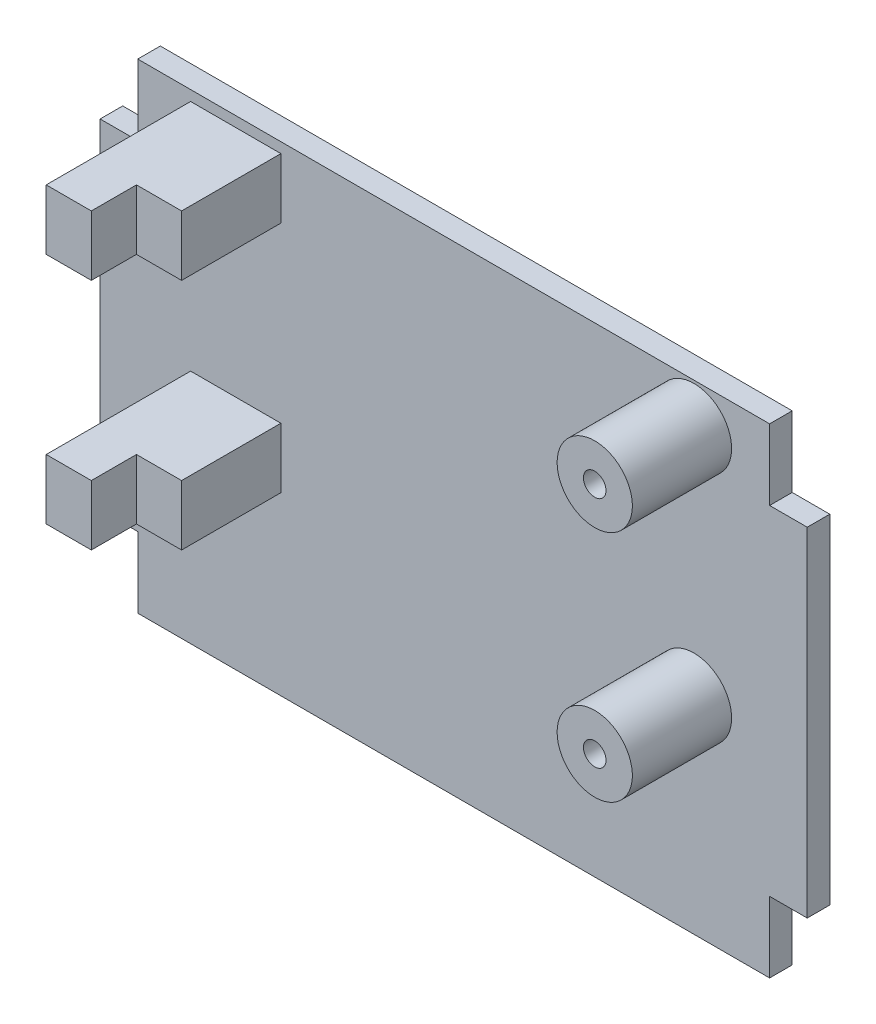
ISO-10303-21;
HEADER;
FILE_DESCRIPTION(('STEP AP214'),'2;1');
FILE_NAME('part.step','',(''),(''),'','','');
FILE_SCHEMA(('AUTOMOTIVE_DESIGN { 1 0 10303 214 1 1 1 1 }'));
ENDSEC;
DATA;
#1=APPLICATION_CONTEXT('core data for automotive mechanical design processes');
#2=APPLICATION_PROTOCOL_DEFINITION('international standard','automotive_design',2000,#1);
#3=PRODUCT_CONTEXT('',#1,'mechanical');
#4=PRODUCT('Part','Part','',(#3));
#5=PRODUCT_RELATED_PRODUCT_CATEGORY('part','',(#4));
#6=PRODUCT_DEFINITION_FORMATION('','',#4);
#7=PRODUCT_DEFINITION_CONTEXT('part definition',#1,'design');
#8=PRODUCT_DEFINITION('design','',#6,#7);
#9=PRODUCT_DEFINITION_SHAPE('','',#8);
#10=(LENGTH_UNIT() NAMED_UNIT(*) SI_UNIT(.MILLI.,.METRE.));
#11=(NAMED_UNIT(*) PLANE_ANGLE_UNIT() SI_UNIT($,.RADIAN.));
#12=(NAMED_UNIT(*) SI_UNIT($,.STERADIAN.) SOLID_ANGLE_UNIT());
#13=UNCERTAINTY_MEASURE_WITH_UNIT(LENGTH_MEASURE(1.E-05),#10,'distance_accuracy_value','');
#14=(GEOMETRIC_REPRESENTATION_CONTEXT(3) GLOBAL_UNCERTAINTY_ASSIGNED_CONTEXT((#13)) GLOBAL_UNIT_ASSIGNED_CONTEXT((#10,
#11,#12)) REPRESENTATION_CONTEXT('',''));
#15=CARTESIAN_POINT('',(0.,0.,0.));
#16=DIRECTION('',(0.,0.,1.));
#17=DIRECTION('',(1.,0.,0.));
#18=AXIS2_PLACEMENT_3D('',#15,#16,#17);
#19=CARTESIAN_POINT('',(11.5740112169334,16.372500000003,8.09906441460411));
#20=DIRECTION('',(0.,0.,-1.));
#21=DIRECTION('',(-1.,0.,0.));
#22=AXIS2_PLACEMENT_3D('',#19,#20,#21);
#23=PLANE('',#22);
#24=DIRECTION('',(0.,1.,0.));
#25=VECTOR('',#24,1.);
#26=CARTESIAN_POINT('',(9.01401121693351,0.,8.09906441460411));
#27=LINE('',#26,#25);
#28=CARTESIAN_POINT('',(9.01401121693351,11.6925000000033,8.09906441460411));
#29=VERTEX_POINT('',#28);
#30=CARTESIAN_POINT('',(9.01401121693351,15.6925000000032,8.09906441460411));
#31=VERTEX_POINT('',#30);
#32=EDGE_CURVE('E49',#29,#31,#27,.T.);
#33=ORIENTED_EDGE('',*,*,#32,.F.);
#34=DIRECTION('',(-1.,0.,0.));
#35=VECTOR('',#34,1.);
#36=CARTESIAN_POINT('',(6.01401121693351,11.6925000000033,8.09906441460411));
#37=LINE('',#36,#35);
#38=CARTESIAN_POINT('',(12.0140112169335,11.6925000000033,8.09906441460411));
#39=VERTEX_POINT('',#38);
#40=EDGE_CURVE('E255',#39,#29,#37,.T.);
#41=ORIENTED_EDGE('',*,*,#40,.F.);
#42=DIRECTION('',(0.,-1.,0.));
#43=VECTOR('',#42,1.);
#44=CARTESIAN_POINT('',(12.0140112169335,11.6925000000033,8.09906441460411));
#45=LINE('',#44,#43);
#46=CARTESIAN_POINT('',(12.0140112169335,15.6925000000033,8.09906441460411));
#47=VERTEX_POINT('',#46);
#48=EDGE_CURVE('E252',#47,#39,#45,.T.);
#49=ORIENTED_EDGE('',*,*,#48,.F.);
#50=DIRECTION('',(1.,0.,0.));
#51=VECTOR('',#50,1.);
#52=CARTESIAN_POINT('',(6.01401121693352,15.6925000000033,8.09906441460411));
#53=LINE('',#52,#51);
#54=EDGE_CURVE('E208',#31,#47,#53,.T.);
#55=ORIENTED_EDGE('',*,*,#54,.F.);
#56=EDGE_LOOP('',(#33,#41,#49,#55));
#57=FACE_BOUND('',#56,.T.);
#58=ADVANCED_FACE('F34',(#57),#23,.F.);
#59=CARTESIAN_POINT('',(0.,0.,1.5));
#60=DIRECTION('',(0.,0.,-1.));
#61=DIRECTION('',(-1.,0.,0.));
#62=AXIS2_PLACEMENT_3D('',#59,#60,#61);
#63=PLANE('',#62);
#64=DIRECTION('',(-1.,0.,0.));
#65=VECTOR('',#64,1.);
#66=CARTESIAN_POINT('',(6.01401121693352,31.2125000000011,1.5));
#67=LINE('',#66,#65);
#68=CARTESIAN_POINT('',(12.0140112169335,31.2125000000011,1.5));
#69=VERTEX_POINT('',#68);
#70=CARTESIAN_POINT('',(6.01401121693352,31.2125000000011,1.5));
#71=VERTEX_POINT('',#70);
#72=EDGE_CURVE('E294',#69,#71,#67,.T.);
#73=ORIENTED_EDGE('',*,*,#72,.F.);
#74=DIRECTION('',(0.,1.,0.));
#75=VECTOR('',#74,1.);
#76=CARTESIAN_POINT('',(12.0140112169335,31.2125000000011,1.5));
#77=LINE('',#76,#75);
#78=CARTESIAN_POINT('',(12.0140112169335,27.2125000000011,1.5));
#79=VERTEX_POINT('',#78);
#80=EDGE_CURVE('E291',#79,#69,#77,.T.);
#81=ORIENTED_EDGE('',*,*,#80,.F.);
#82=DIRECTION('',(1.,0.,0.));
#83=VECTOR('',#82,1.);
#84=CARTESIAN_POINT('',(6.01401121693352,27.2125000000011,1.5));
#85=LINE('',#84,#83);
#86=CARTESIAN_POINT('',(6.01401121693352,27.2125000000011,1.5));
#87=VERTEX_POINT('',#86);
#88=EDGE_CURVE('E288',#87,#79,#85,.T.);
#89=ORIENTED_EDGE('',*,*,#88,.F.);
#90=DIRECTION('',(0.,-1.,0.));
#91=VECTOR('',#90,1.);
#92=CARTESIAN_POINT('',(6.01401121693352,31.2125000000011,1.5));
#93=LINE('',#92,#91);
#94=EDGE_CURVE('E277',#71,#87,#93,.T.);
#95=ORIENTED_EDGE('',*,*,#94,.F.);
#96=EDGE_LOOP('',(#73,#81,#89,#95));
#97=FACE_BOUND('',#96,.T.);
#98=CARTESIAN_POINT('',(39.4740112169336,29.2125000000011,1.5));
#99=DIRECTION('',(0.,0.,-1.));
#100=DIRECTION('',(-1.,0.,0.));
#101=AXIS2_PLACEMENT_3D('',#98,#99,#100);
#102=CIRCLE('',#101,2.5);
#103=CARTESIAN_POINT('',(36.9740112169336,29.2125000000011,1.5));
#104=VERTEX_POINT('',#103);
#105=EDGE_CURVE('E42',#104,#104,#102,.F.);
#106=ORIENTED_EDGE('',*,*,#105,.F.);
#107=EDGE_LOOP('',(#106));
#108=FACE_BOUND('',#107,.T.);
#109=DIRECTION('',(-1.,0.,0.));
#110=VECTOR('',#109,1.);
#111=CARTESIAN_POINT('',(0.,31.9,1.5));
#112=LINE('',#111,#110);
#113=CARTESIAN_POINT('',(44.5,31.9,1.5));
#114=VERTEX_POINT('',#113);
#115=CARTESIAN_POINT('',(2.50000000000001,31.9,1.5));
#116=VERTEX_POINT('',#115);
#117=EDGE_CURVE('E395',#114,#116,#112,.T.);
#118=ORIENTED_EDGE('',*,*,#117,.T.);
#119=DIRECTION('',(0.,1.,0.));
#120=VECTOR('',#119,1.);
#121=CARTESIAN_POINT('',(2.50000000000001,31.9,1.5));
#122=LINE('',#121,#120);
#123=CARTESIAN_POINT('',(2.5,27.2,1.5));
#124=VERTEX_POINT('',#123);
#125=EDGE_CURVE('E355',#124,#116,#122,.T.);
#126=ORIENTED_EDGE('',*,*,#125,.F.);
#127=DIRECTION('',(1.,0.,0.));
#128=VECTOR('',#127,1.);
#129=CARTESIAN_POINT('',(0.,27.2,1.5));
#130=LINE('',#129,#128);
#131=CARTESIAN_POINT('',(0.,27.2,1.5));
#132=VERTEX_POINT('',#131);
#133=EDGE_CURVE('E312',#132,#124,#130,.T.);
#134=ORIENTED_EDGE('',*,*,#133,.F.);
#135=DIRECTION('',(0.,-1.,0.));
#136=VECTOR('',#135,1.);
#137=CARTESIAN_POINT('',(0.,0.,1.5));
#138=LINE('',#137,#136);
#139=CARTESIAN_POINT('',(0.,4.7,1.5));
#140=VERTEX_POINT('',#139);
#141=EDGE_CURVE('E385',#132,#140,#138,.T.);
#142=ORIENTED_EDGE('',*,*,#141,.T.);
#143=DIRECTION('',(-1.,0.,0.));
#144=VECTOR('',#143,1.);
#145=CARTESIAN_POINT('',(0.,4.7,1.5));
#146=LINE('',#145,#144);
#147=CARTESIAN_POINT('',(2.5,4.7,1.5));
#148=VERTEX_POINT('',#147);
#149=EDGE_CURVE('E337',#148,#140,#146,.T.);
#150=ORIENTED_EDGE('',*,*,#149,.F.);
#151=DIRECTION('',(0.,1.,0.));
#152=VECTOR('',#151,1.);
#153=CARTESIAN_POINT('',(2.50000000000001,0.,1.5));
#154=LINE('',#153,#152);
#155=CARTESIAN_POINT('',(2.50000000000001,0.,1.5));
#156=VERTEX_POINT('',#155);
#157=EDGE_CURVE('E341',#156,#148,#154,.T.);
#158=ORIENTED_EDGE('',*,*,#157,.F.);
#159=DIRECTION('',(1.,0.,0.));
#160=VECTOR('',#159,1.);
#161=CARTESIAN_POINT('',(0.,0.,1.5));
#162=LINE('',#161,#160);
#163=CARTESIAN_POINT('',(44.5,0.,1.5));
#164=VERTEX_POINT('',#163);
#165=EDGE_CURVE('E388',#156,#164,#162,.T.);
#166=ORIENTED_EDGE('',*,*,#165,.T.);
#167=DIRECTION('',(0.,-1.,0.));
#168=VECTOR('',#167,1.);
#169=CARTESIAN_POINT('',(44.5,0.,1.5));
#170=LINE('',#169,#168);
#171=CARTESIAN_POINT('',(44.5,4.7,1.5));
#172=VERTEX_POINT('',#171);
#173=EDGE_CURVE('E317',#172,#164,#170,.T.);
#174=ORIENTED_EDGE('',*,*,#173,.F.);
#175=DIRECTION('',(-1.,0.,0.));
#176=VECTOR('',#175,1.);
#177=CARTESIAN_POINT('',(47.,4.7,1.5));
#178=LINE('',#177,#176);
#179=CARTESIAN_POINT('',(47.,4.7,1.5));
#180=VERTEX_POINT('',#179);
#181=EDGE_CURVE('E321',#180,#172,#178,.T.);
#182=ORIENTED_EDGE('',*,*,#181,.F.);
#183=DIRECTION('',(0.,1.,0.));
#184=VECTOR('',#183,1.);
#185=CARTESIAN_POINT('',(47.,0.,1.5));
#186=LINE('',#185,#184);
#187=CARTESIAN_POINT('',(47.,27.2,1.5));
#188=VERTEX_POINT('',#187);
#189=EDGE_CURVE('E392',#180,#188,#186,.T.);
#190=ORIENTED_EDGE('',*,*,#189,.T.);
#191=DIRECTION('',(1.,0.,0.));
#192=VECTOR('',#191,1.);
#193=CARTESIAN_POINT('',(47.,27.2,1.5));
#194=LINE('',#193,#192);
#195=CARTESIAN_POINT('',(44.5,27.2,1.5));
#196=VERTEX_POINT('',#195);
#197=EDGE_CURVE('E371',#196,#188,#194,.T.);
#198=ORIENTED_EDGE('',*,*,#197,.F.);
#199=DIRECTION('',(0.,-1.,0.));
#200=VECTOR('',#199,1.);
#201=CARTESIAN_POINT('',(44.5,31.9,1.5));
#202=LINE('',#201,#200);
#203=EDGE_CURVE('E329',#114,#196,#202,.T.);
#204=ORIENTED_EDGE('',*,*,#203,.F.);
#205=EDGE_LOOP('',(#118,#126,#134,#142,#150,#158,#166,#174,#182,#190,#198,#204));
#206=FACE_BOUND('',#205,.T.);
#207=CARTESIAN_POINT('',(39.4740112169336,13.6925000000032,1.5));
#208=DIRECTION('',(0.,0.,-1.));
#209=DIRECTION('',(-1.,0.,0.));
#210=AXIS2_PLACEMENT_3D('',#207,#208,#209);
#211=CIRCLE('',#210,2.5);
#212=CARTESIAN_POINT('',(36.9740112169336,13.6925000000032,1.5));
#213=VERTEX_POINT('',#212);
#214=EDGE_CURVE('E11',#213,#213,#211,.F.);
#215=ORIENTED_EDGE('',*,*,#214,.F.);
#216=EDGE_LOOP('',(#215));
#217=FACE_BOUND('',#216,.T.);
#218=DIRECTION('',(-1.,0.,0.));
#219=VECTOR('',#218,1.);
#220=CARTESIAN_POINT('',(6.01401121693352,15.6925000000033,1.5));
#221=LINE('',#220,#219);
#222=CARTESIAN_POINT('',(12.0140112169335,15.6925000000033,1.5));
#223=VERTEX_POINT('',#222);
#224=CARTESIAN_POINT('',(6.01401121693352,15.6925000000033,1.5));
#225=VERTEX_POINT('',#224);
#226=EDGE_CURVE('E264',#223,#225,#221,.T.);
#227=ORIENTED_EDGE('',*,*,#226,.F.);
#228=DIRECTION('',(0.,1.,0.));
#229=VECTOR('',#228,1.);
#230=CARTESIAN_POINT('',(12.0140112169335,11.6925000000033,1.5));
#231=LINE('',#230,#229);
#232=CARTESIAN_POINT('',(12.0140112169335,11.6925000000033,1.5));
#233=VERTEX_POINT('',#232);
#234=EDGE_CURVE('E261',#233,#223,#231,.T.);
#235=ORIENTED_EDGE('',*,*,#234,.F.);
#236=DIRECTION('',(1.,0.,0.));
#237=VECTOR('',#236,1.);
#238=CARTESIAN_POINT('',(6.01401121693351,11.6925000000033,1.5));
#239=LINE('',#238,#237);
#240=CARTESIAN_POINT('',(6.01401121693351,11.6925000000033,1.5));
#241=VERTEX_POINT('',#240);
#242=EDGE_CURVE('E259',#241,#233,#239,.T.);
#243=ORIENTED_EDGE('',*,*,#242,.F.);
#244=DIRECTION('',(0.,-1.,0.));
#245=VECTOR('',#244,1.);
#246=CARTESIAN_POINT('',(6.01401121693351,11.6925000000033,1.5));
#247=LINE('',#246,#245);
#248=EDGE_CURVE('E205',#225,#241,#247,.T.);
#249=ORIENTED_EDGE('',*,*,#248,.F.);
#250=EDGE_LOOP('',(#227,#235,#243,#249));
#251=FACE_BOUND('',#250,.T.);
#252=ADVANCED_FACE('F412',(#97,#108,#206,#217,#251),#63,.F.);
#253=CARTESIAN_POINT('',(0.,0.,1.5));
#254=DIRECTION('',(1.,0.,0.));
#255=DIRECTION('',(0.,0.,-1.));
#256=AXIS2_PLACEMENT_3D('',#253,#254,#255);
#257=PLANE('',#256);
#258=ORIENTED_EDGE('',*,*,#141,.F.);
#259=DIRECTION('',(0.,0.,1.));
#260=VECTOR('',#259,1.);
#261=CARTESIAN_POINT('',(0.,27.2,0.));
#262=LINE('',#261,#260);
#263=CARTESIAN_POINT('',(0.,27.2,0.));
#264=VERTEX_POINT('',#263);
#265=EDGE_CURVE('E358',#264,#132,#262,.T.);
#266=ORIENTED_EDGE('',*,*,#265,.F.);
#267=DIRECTION('',(0.,-1.,0.));
#268=VECTOR('',#267,1.);
#269=CARTESIAN_POINT('',(0.,0.,0.));
#270=LINE('',#269,#268);
#271=CARTESIAN_POINT('',(0.,4.7,0.));
#272=VERTEX_POINT('',#271);
#273=EDGE_CURVE('E381',#264,#272,#270,.T.);
#274=ORIENTED_EDGE('',*,*,#273,.T.);
#275=DIRECTION('',(0.,0.,1.));
#276=VECTOR('',#275,1.);
#277=CARTESIAN_POINT('',(0.,4.7,0.));
#278=LINE('',#277,#276);
#279=EDGE_CURVE('E324',#272,#140,#278,.T.);
#280=ORIENTED_EDGE('',*,*,#279,.T.);
#281=EDGE_LOOP('',(#258,#266,#274,#280));
#282=FACE_BOUND('',#281,.T.);
#283=ADVANCED_FACE('F36',(#282),#257,.F.);
#284=CARTESIAN_POINT('',(0.,0.,1.5));
#285=DIRECTION('',(0.,1.,0.));
#286=DIRECTION('',(0.,0.,1.));
#287=AXIS2_PLACEMENT_3D('',#284,#285,#286);
#288=PLANE('',#287);
#289=ORIENTED_EDGE('',*,*,#165,.F.);
#290=DIRECTION('',(0.,0.,1.));
#291=VECTOR('',#290,1.);
#292=CARTESIAN_POINT('',(2.50000000000001,0.,0.));
#293=LINE('',#292,#291);
#294=CARTESIAN_POINT('',(2.50000000000001,0.,0.));
#295=VERTEX_POINT('',#294);
#296=EDGE_CURVE('E340',#295,#156,#293,.T.);
#297=ORIENTED_EDGE('',*,*,#296,.F.);
#298=DIRECTION('',(1.,0.,0.));
#299=VECTOR('',#298,1.);
#300=CARTESIAN_POINT('',(0.,0.,0.));
#301=LINE('',#300,#299);
#302=CARTESIAN_POINT('',(44.5,0.,0.));
#303=VERTEX_POINT('',#302);
#304=EDGE_CURVE('E400',#295,#303,#301,.T.);
#305=ORIENTED_EDGE('',*,*,#304,.T.);
#306=DIRECTION('',(0.,0.,1.));
#307=VECTOR('',#306,1.);
#308=CARTESIAN_POINT('',(44.5,0.,0.));
#309=LINE('',#308,#307);
#310=EDGE_CURVE('E326',#303,#164,#309,.T.);
#311=ORIENTED_EDGE('',*,*,#310,.T.);
#312=EDGE_LOOP('',(#289,#297,#305,#311));
#313=FACE_BOUND('',#312,.T.);
#314=ADVANCED_FACE('F535',(#313),#288,.F.);
#315=CARTESIAN_POINT('',(47.,0.,1.5));
#316=DIRECTION('',(-1.,0.,0.));
#317=DIRECTION('',(0.,0.,1.));
#318=AXIS2_PLACEMENT_3D('',#315,#316,#317);
#319=PLANE('',#318);
#320=ORIENTED_EDGE('',*,*,#189,.F.);
#321=DIRECTION('',(0.,0.,1.));
#322=VECTOR('',#321,1.);
#323=CARTESIAN_POINT('',(47.,4.7,0.));
#324=LINE('',#323,#322);
#325=CARTESIAN_POINT('',(47.,4.7,0.));
#326=VERTEX_POINT('',#325);
#327=EDGE_CURVE('E320',#326,#180,#324,.T.);
#328=ORIENTED_EDGE('',*,*,#327,.F.);
#329=DIRECTION('',(0.,1.,0.));
#330=VECTOR('',#329,1.);
#331=CARTESIAN_POINT('',(47.,0.,0.));
#332=LINE('',#331,#330);
#333=CARTESIAN_POINT('',(47.,27.2,0.));
#334=VERTEX_POINT('',#333);
#335=EDGE_CURVE('E403',#326,#334,#332,.T.);
#336=ORIENTED_EDGE('',*,*,#335,.T.);
#337=DIRECTION('',(0.,0.,1.));
#338=VECTOR('',#337,1.);
#339=CARTESIAN_POINT('',(47.,27.2,0.));
#340=LINE('',#339,#338);
#341=EDGE_CURVE('E378',#334,#188,#340,.T.);
#342=ORIENTED_EDGE('',*,*,#341,.T.);
#343=EDGE_LOOP('',(#320,#328,#336,#342));
#344=FACE_BOUND('',#343,.T.);
#345=ADVANCED_FACE('F532',(#344),#319,.F.);
#346=CARTESIAN_POINT('',(0.,31.9,1.5));
#347=DIRECTION('',(0.,-1.,0.));
#348=DIRECTION('',(0.,0.,-1.));
#349=AXIS2_PLACEMENT_3D('',#346,#347,#348);
#350=PLANE('',#349);
#351=DIRECTION('',(-1.,0.,0.));
#352=VECTOR('',#351,1.);
#353=CARTESIAN_POINT('',(0.,31.9,0.));
#354=LINE('',#353,#352);
#355=CARTESIAN_POINT('',(44.5,31.9,0.));
#356=VERTEX_POINT('',#355);
#357=CARTESIAN_POINT('',(2.50000000000001,31.9,0.));
#358=VERTEX_POINT('',#357);
#359=EDGE_CURVE('E389',#356,#358,#354,.T.);
#360=ORIENTED_EDGE('',*,*,#359,.T.);
#361=DIRECTION('',(0.,0.,1.));
#362=VECTOR('',#361,1.);
#363=CARTESIAN_POINT('',(2.50000000000001,31.9,0.));
#364=LINE('',#363,#362);
#365=EDGE_CURVE('E344',#358,#116,#364,.T.);
#366=ORIENTED_EDGE('',*,*,#365,.T.);
#367=ORIENTED_EDGE('',*,*,#117,.F.);
#368=DIRECTION('',(0.,0.,1.));
#369=VECTOR('',#368,1.);
#370=CARTESIAN_POINT('',(44.5,31.9,0.));
#371=LINE('',#370,#369);
#372=EDGE_CURVE('E374',#356,#114,#371,.T.);
#373=ORIENTED_EDGE('',*,*,#372,.F.);
#374=EDGE_LOOP('',(#360,#366,#367,#373));
#375=FACE_BOUND('',#374,.T.);
#376=ADVANCED_FACE('F528',(#375),#350,.F.);
#377=CARTESIAN_POINT('',(0.,0.,0.));
#378=DIRECTION('',(0.,0.,-1.));
#379=DIRECTION('',(-1.,0.,0.));
#380=AXIS2_PLACEMENT_3D('',#377,#378,#379);
#381=PLANE('',#380);
#382=DIRECTION('',(0.,1.,0.));
#383=VECTOR('',#382,1.);
#384=CARTESIAN_POINT('',(2.50000000000001,31.9,0.));
#385=LINE('',#384,#383);
#386=CARTESIAN_POINT('',(2.5,27.2,0.));
#387=VERTEX_POINT('',#386);
#388=EDGE_CURVE('E354',#387,#358,#385,.T.);
#389=ORIENTED_EDGE('',*,*,#388,.T.);
#390=ORIENTED_EDGE('',*,*,#359,.F.);
#391=DIRECTION('',(0.,-1.,0.));
#392=VECTOR('',#391,1.);
#393=CARTESIAN_POINT('',(44.5,31.9,0.));
#394=LINE('',#393,#392);
#395=CARTESIAN_POINT('',(44.5,27.2,0.));
#396=VERTEX_POINT('',#395);
#397=EDGE_CURVE('E367',#356,#396,#394,.T.);
#398=ORIENTED_EDGE('',*,*,#397,.T.);
#399=DIRECTION('',(1.,0.,0.));
#400=VECTOR('',#399,1.);
#401=CARTESIAN_POINT('',(47.,27.2,0.));
#402=LINE('',#401,#400);
#403=EDGE_CURVE('E370',#396,#334,#402,.T.);
#404=ORIENTED_EDGE('',*,*,#403,.T.);
#405=ORIENTED_EDGE('',*,*,#335,.F.);
#406=DIRECTION('',(-1.,0.,0.));
#407=VECTOR('',#406,1.);
#408=CARTESIAN_POINT('',(47.,4.7,0.));
#409=LINE('',#408,#407);
#410=CARTESIAN_POINT('',(44.5,4.7,0.));
#411=VERTEX_POINT('',#410);
#412=EDGE_CURVE('E313',#326,#411,#409,.T.);
#413=ORIENTED_EDGE('',*,*,#412,.T.);
#414=DIRECTION('',(0.,-1.,0.));
#415=VECTOR('',#414,1.);
#416=CARTESIAN_POINT('',(44.5,0.,0.));
#417=LINE('',#416,#415);
#418=EDGE_CURVE('E316',#411,#303,#417,.T.);
#419=ORIENTED_EDGE('',*,*,#418,.T.);
#420=ORIENTED_EDGE('',*,*,#304,.F.);
#421=DIRECTION('',(0.,1.,0.));
#422=VECTOR('',#421,1.);
#423=CARTESIAN_POINT('',(2.50000000000001,0.,0.));
#424=LINE('',#423,#422);
#425=CARTESIAN_POINT('',(2.5,4.7,0.));
#426=VERTEX_POINT('',#425);
#427=EDGE_CURVE('E333',#295,#426,#424,.T.);
#428=ORIENTED_EDGE('',*,*,#427,.T.);
#429=DIRECTION('',(-1.,0.,0.));
#430=VECTOR('',#429,1.);
#431=CARTESIAN_POINT('',(0.,4.7,0.));
#432=LINE('',#431,#430);
#433=EDGE_CURVE('E336',#426,#272,#432,.T.);
#434=ORIENTED_EDGE('',*,*,#433,.T.);
#435=ORIENTED_EDGE('',*,*,#273,.F.);
#436=DIRECTION('',(1.,0.,0.));
#437=VECTOR('',#436,1.);
#438=CARTESIAN_POINT('',(0.,27.2,0.));
#439=LINE('',#438,#437);
#440=EDGE_CURVE('E351',#264,#387,#439,.T.);
#441=ORIENTED_EDGE('',*,*,#440,.T.);
#442=EDGE_LOOP('',(#389,#390,#398,#404,#405,#413,#419,#420,#428,#434,#435,#441));
#443=FACE_BOUND('',#442,.T.);
#444=ADVANCED_FACE('F521',(#443),#381,.T.);
#445=CARTESIAN_POINT('',(47.,27.2,0.));
#446=DIRECTION('',(0.,-1.,0.));
#447=DIRECTION('',(0.,0.,-1.));
#448=AXIS2_PLACEMENT_3D('',#445,#446,#447);
#449=PLANE('',#448);
#450=ORIENTED_EDGE('',*,*,#197,.T.);
#451=ORIENTED_EDGE('',*,*,#341,.F.);
#452=ORIENTED_EDGE('',*,*,#403,.F.);
#453=DIRECTION('',(0.,0.,1.));
#454=VECTOR('',#453,1.);
#455=CARTESIAN_POINT('',(44.5,27.2,0.));
#456=LINE('',#455,#454);
#457=EDGE_CURVE('E382',#396,#196,#456,.T.);
#458=ORIENTED_EDGE('',*,*,#457,.T.);
#459=EDGE_LOOP('',(#450,#451,#452,#458));
#460=FACE_BOUND('',#459,.T.);
#461=ADVANCED_FACE('F518',(#460),#449,.F.);
#462=CARTESIAN_POINT('',(44.5,31.9,0.));
#463=DIRECTION('',(-1.,0.,0.));
#464=DIRECTION('',(0.,-1.,0.));
#465=AXIS2_PLACEMENT_3D('',#462,#463,#464);
#466=PLANE('',#465);
#467=ORIENTED_EDGE('',*,*,#203,.T.);
#468=ORIENTED_EDGE('',*,*,#457,.F.);
#469=ORIENTED_EDGE('',*,*,#397,.F.);
#470=ORIENTED_EDGE('',*,*,#372,.T.);
#471=EDGE_LOOP('',(#467,#468,#469,#470));
#472=FACE_BOUND('',#471,.T.);
#473=ADVANCED_FACE('F498',(#472),#466,.F.);
#474=CARTESIAN_POINT('',(44.5,0.,0.));
#475=DIRECTION('',(-1.,0.,0.));
#476=DIRECTION('',(0.,-1.,0.));
#477=AXIS2_PLACEMENT_3D('',#474,#475,#476);
#478=PLANE('',#477);
#479=ORIENTED_EDGE('',*,*,#173,.T.);
#480=ORIENTED_EDGE('',*,*,#310,.F.);
#481=ORIENTED_EDGE('',*,*,#418,.F.);
#482=DIRECTION('',(0.,0.,1.));
#483=VECTOR('',#482,1.);
#484=CARTESIAN_POINT('',(44.5,4.7,0.));
#485=LINE('',#484,#483);
#486=EDGE_CURVE('E330',#411,#172,#485,.T.);
#487=ORIENTED_EDGE('',*,*,#486,.T.);
#488=EDGE_LOOP('',(#479,#480,#481,#487));
#489=FACE_BOUND('',#488,.T.);
#490=ADVANCED_FACE('F494',(#489),#478,.F.);
#491=CARTESIAN_POINT('',(47.,4.7,0.));
#492=DIRECTION('',(0.,1.,0.));
#493=DIRECTION('',(0.,0.,1.));
#494=AXIS2_PLACEMENT_3D('',#491,#492,#493);
#495=PLANE('',#494);
#496=ORIENTED_EDGE('',*,*,#181,.T.);
#497=ORIENTED_EDGE('',*,*,#486,.F.);
#498=ORIENTED_EDGE('',*,*,#412,.F.);
#499=ORIENTED_EDGE('',*,*,#327,.T.);
#500=EDGE_LOOP('',(#496,#497,#498,#499));
#501=FACE_BOUND('',#500,.T.);
#502=ADVANCED_FACE('F497',(#501),#495,.F.);
#503=CARTESIAN_POINT('',(0.,4.7,0.));
#504=DIRECTION('',(0.,1.,0.));
#505=DIRECTION('',(0.,0.,1.));
#506=AXIS2_PLACEMENT_3D('',#503,#504,#505);
#507=PLANE('',#506);
#508=ORIENTED_EDGE('',*,*,#149,.T.);
#509=ORIENTED_EDGE('',*,*,#279,.F.);
#510=ORIENTED_EDGE('',*,*,#433,.F.);
#511=DIRECTION('',(0.,0.,1.));
#512=VECTOR('',#511,1.);
#513=CARTESIAN_POINT('',(2.5,4.7,0.));
#514=LINE('',#513,#512);
#515=EDGE_CURVE('E348',#426,#148,#514,.T.);
#516=ORIENTED_EDGE('',*,*,#515,.T.);
#517=EDGE_LOOP('',(#508,#509,#510,#516));
#518=FACE_BOUND('',#517,.T.);
#519=ADVANCED_FACE('F502',(#518),#507,.F.);
#520=CARTESIAN_POINT('',(2.50000000000001,0.,0.));
#521=DIRECTION('',(1.,0.,0.));
#522=DIRECTION('',(0.,1.,0.));
#523=AXIS2_PLACEMENT_3D('',#520,#521,#522);
#524=PLANE('',#523);
#525=ORIENTED_EDGE('',*,*,#157,.T.);
#526=ORIENTED_EDGE('',*,*,#515,.F.);
#527=ORIENTED_EDGE('',*,*,#427,.F.);
#528=ORIENTED_EDGE('',*,*,#296,.T.);
#529=EDGE_LOOP('',(#525,#526,#527,#528));
#530=FACE_BOUND('',#529,.T.);
#531=ADVANCED_FACE('F506',(#530),#524,.F.);
#532=CARTESIAN_POINT('',(2.50000000000001,31.9,0.));
#533=DIRECTION('',(1.,0.,0.));
#534=DIRECTION('',(0.,1.,0.));
#535=AXIS2_PLACEMENT_3D('',#532,#533,#534);
#536=PLANE('',#535);
#537=ORIENTED_EDGE('',*,*,#125,.T.);
#538=ORIENTED_EDGE('',*,*,#365,.F.);
#539=ORIENTED_EDGE('',*,*,#388,.F.);
#540=DIRECTION('',(0.,0.,1.));
#541=VECTOR('',#540,1.);
#542=CARTESIAN_POINT('',(2.5,27.2,0.));
#543=LINE('',#542,#541);
#544=EDGE_CURVE('E364',#387,#124,#543,.T.);
#545=ORIENTED_EDGE('',*,*,#544,.T.);
#546=EDGE_LOOP('',(#537,#538,#539,#545));
#547=FACE_BOUND('',#546,.T.);
#548=ADVANCED_FACE('F510',(#547),#536,.F.);
#549=CARTESIAN_POINT('',(0.,27.2,0.));
#550=DIRECTION('',(0.,-1.,0.));
#551=DIRECTION('',(0.,0.,-1.));
#552=AXIS2_PLACEMENT_3D('',#549,#550,#551);
#553=PLANE('',#552);
#554=ORIENTED_EDGE('',*,*,#133,.T.);
#555=ORIENTED_EDGE('',*,*,#544,.F.);
#556=ORIENTED_EDGE('',*,*,#440,.F.);
#557=ORIENTED_EDGE('',*,*,#265,.T.);
#558=EDGE_LOOP('',(#554,#555,#556,#557));
#559=FACE_BOUND('',#558,.T.);
#560=ADVANCED_FACE('F492',(#559),#553,.F.);
#561=CARTESIAN_POINT('',(39.4740112169336,29.2125000000011,15.3101669655321));
#562=DIRECTION('',(0.,0.,-1.));
#563=DIRECTION('',(-1.,0.,0.));
#564=AXIS2_PLACEMENT_3D('',#561,#562,#563);
#565=CYLINDRICAL_SURFACE('',#564,2.5);
#566=CARTESIAN_POINT('',(39.4740112169336,29.2125000000011,8.09906441460411));
#567=DIRECTION('',(0.,0.,-1.));
#568=DIRECTION('',(-1.,0.,0.));
#569=AXIS2_PLACEMENT_3D('',#566,#567,#568);
#570=CIRCLE('',#569,2.5);
#571=CARTESIAN_POINT('',(36.9740112169336,29.2125000000011,8.09906441460411));
#572=VERTEX_POINT('',#571);
#573=EDGE_CURVE('E285',#572,#572,#570,.T.);
#574=ORIENTED_EDGE('',*,*,#573,.T.);
#575=EDGE_LOOP('',(#574));
#576=FACE_BOUND('',#575,.T.);
#577=ORIENTED_EDGE('',*,*,#105,.T.);
#578=EDGE_LOOP('',(#577));
#579=FACE_BOUND('',#578,.T.);
#580=ADVANCED_FACE('F410',(#576,#579),#565,.T.);
#581=CARTESIAN_POINT('',(11.5740112169334,16.372500000003,8.09906441460411));
#582=DIRECTION('',(0.,0.,-1.));
#583=DIRECTION('',(-1.,0.,0.));
#584=AXIS2_PLACEMENT_3D('',#581,#582,#583);
#585=PLANE('',#584);
#586=CARTESIAN_POINT('',(39.4740112169336,29.2125000000011,8.09906441460411));
#587=DIRECTION('',(0.,0.,1.));
#588=DIRECTION('',(1.,0.,0.));
#589=AXIS2_PLACEMENT_3D('',#586,#587,#588);
#590=CIRCLE('',#589,0.749999999999999);
#591=CARTESIAN_POINT('',(40.2240112169336,29.2125000000011,8.09906441460411));
#592=VERTEX_POINT('',#591);
#593=EDGE_CURVE('E733',#592,#592,#590,.T.);
#594=ORIENTED_EDGE('',*,*,#593,.F.);
#595=EDGE_LOOP('',(#594));
#596=FACE_BOUND('',#595,.T.);
#597=ORIENTED_EDGE('',*,*,#573,.F.);
#598=EDGE_LOOP('',(#597));
#599=FACE_BOUND('',#598,.T.);
#600=ADVANCED_FACE('F475',(#596,#599),#585,.F.);
#601=CARTESIAN_POINT('',(6.01401121693352,31.2125000000011,15.3101669655321));
#602=DIRECTION('',(0.,-1.,0.));
#603=DIRECTION('',(1.,0.,0.));
#604=AXIS2_PLACEMENT_3D('',#601,#602,#603);
#605=PLANE('',#604);
#606=DIRECTION('',(0.,0.,-1.));
#607=VECTOR('',#606,1.);
#608=CARTESIAN_POINT('',(6.01401121693352,31.2125000000011,15.3101669655321));
#609=LINE('',#608,#607);
#610=CARTESIAN_POINT('',(6.01401121693352,31.2125000000011,11.0990644146041));
#611=VERTEX_POINT('',#610);
#612=EDGE_CURVE('E297',#611,#71,#609,.T.);
#613=ORIENTED_EDGE('',*,*,#612,.F.);
#614=DIRECTION('',(-1.,0.,0.));
#615=VECTOR('',#614,1.);
#616=CARTESIAN_POINT('',(0.,31.2125000000011,11.0990644146041));
#617=LINE('',#616,#615);
#618=CARTESIAN_POINT('',(9.01401121693351,31.2125000000011,11.0990644146041));
#619=VERTEX_POINT('',#618);
#620=EDGE_CURVE('E240',#619,#611,#617,.T.);
#621=ORIENTED_EDGE('',*,*,#620,.F.);
#622=DIRECTION('',(0.,0.,-1.));
#623=VECTOR('',#622,1.);
#624=CARTESIAN_POINT('',(9.01401121693351,31.2125000000011,11.0990644146041));
#625=LINE('',#624,#623);
#626=CARTESIAN_POINT('',(9.01401121693351,31.2125000000011,8.09906441460411));
#627=VERTEX_POINT('',#626);
#628=EDGE_CURVE('E250',#619,#627,#625,.T.);
#629=ORIENTED_EDGE('',*,*,#628,.T.);
#630=DIRECTION('',(1.,0.,0.));
#631=VECTOR('',#630,1.);
#632=CARTESIAN_POINT('',(6.01401121693352,31.2125000000011,8.09906441460411));
#633=LINE('',#632,#631);
#634=CARTESIAN_POINT('',(12.0140112169335,31.2125000000011,8.09906441460411));
#635=VERTEX_POINT('',#634);
#636=EDGE_CURVE('E282',#627,#635,#633,.T.);
#637=ORIENTED_EDGE('',*,*,#636,.T.);
#638=DIRECTION('',(0.,0.,-1.));
#639=VECTOR('',#638,1.);
#640=CARTESIAN_POINT('',(12.0140112169335,31.2125000000011,15.3101669655321));
#641=LINE('',#640,#639);
#642=EDGE_CURVE('E300',#635,#69,#641,.T.);
#643=ORIENTED_EDGE('',*,*,#642,.T.);
#644=ORIENTED_EDGE('',*,*,#72,.T.);
#645=EDGE_LOOP('',(#613,#621,#629,#637,#643,#644));
#646=FACE_BOUND('',#645,.T.);
#647=ADVANCED_FACE('F471',(#646),#605,.F.);
#648=CARTESIAN_POINT('',(12.0140112169335,31.2125000000011,15.3101669655321));
#649=DIRECTION('',(-1.,0.,0.));
#650=DIRECTION('',(0.,0.,1.));
#651=AXIS2_PLACEMENT_3D('',#648,#649,#650);
#652=PLANE('',#651);
#653=ORIENTED_EDGE('',*,*,#642,.F.);
#654=DIRECTION('',(0.,-1.,0.));
#655=VECTOR('',#654,1.);
#656=CARTESIAN_POINT('',(12.0140112169335,31.2125000000011,8.09906441460411));
#657=LINE('',#656,#655);
#658=CARTESIAN_POINT('',(12.0140112169335,27.2125000000011,8.09906441460411));
#659=VERTEX_POINT('',#658);
#660=EDGE_CURVE('E278',#635,#659,#657,.T.);
#661=ORIENTED_EDGE('',*,*,#660,.T.);
#662=DIRECTION('',(0.,0.,-1.));
#663=VECTOR('',#662,1.);
#664=CARTESIAN_POINT('',(12.0140112169335,27.2125000000011,15.3101669655321));
#665=LINE('',#664,#663);
#666=EDGE_CURVE('E303',#659,#79,#665,.T.);
#667=ORIENTED_EDGE('',*,*,#666,.T.);
#668=ORIENTED_EDGE('',*,*,#80,.T.);
#669=EDGE_LOOP('',(#653,#661,#667,#668));
#670=FACE_BOUND('',#669,.T.);
#671=ADVANCED_FACE('F474',(#670),#652,.F.);
#672=CARTESIAN_POINT('',(6.01401121693352,27.2125000000011,15.3101669655321));
#673=DIRECTION('',(0.,1.,0.));
#674=DIRECTION('',(0.,0.,1.));
#675=AXIS2_PLACEMENT_3D('',#672,#673,#674);
#676=PLANE('',#675);
#677=ORIENTED_EDGE('',*,*,#666,.F.);
#678=DIRECTION('',(-1.,0.,0.));
#679=VECTOR('',#678,1.);
#680=CARTESIAN_POINT('',(6.01401121693352,27.2125000000011,8.09906441460411));
#681=LINE('',#680,#679);
#682=CARTESIAN_POINT('',(9.01401121693351,27.2125000000011,8.09906441460411));
#683=VERTEX_POINT('',#682);
#684=EDGE_CURVE('E281',#659,#683,#681,.T.);
#685=ORIENTED_EDGE('',*,*,#684,.T.);
#686=DIRECTION('',(0.,0.,-1.));
#687=VECTOR('',#686,1.);
#688=CARTESIAN_POINT('',(9.01401121693351,27.2125000000011,11.0990644146041));
#689=LINE('',#688,#687);
#690=CARTESIAN_POINT('',(9.01401121693351,27.2125000000011,11.0990644146041));
#691=VERTEX_POINT('',#690);
#692=EDGE_CURVE('E57',#691,#683,#689,.T.);
#693=ORIENTED_EDGE('',*,*,#692,.F.);
#694=DIRECTION('',(1.,0.,0.));
#695=VECTOR('',#694,1.);
#696=CARTESIAN_POINT('',(0.,27.2125000000011,11.0990644146041));
#697=LINE('',#696,#695);
#698=CARTESIAN_POINT('',(6.01401121693352,27.2125000000011,11.0990644146041));
#699=VERTEX_POINT('',#698);
#700=EDGE_CURVE('E246',#699,#691,#697,.T.);
#701=ORIENTED_EDGE('',*,*,#700,.F.);
#702=DIRECTION('',(0.,0.,-1.));
#703=VECTOR('',#702,1.);
#704=CARTESIAN_POINT('',(6.01401121693352,27.2125000000011,15.3101669655321));
#705=LINE('',#704,#703);
#706=EDGE_CURVE('E306',#699,#87,#705,.T.);
#707=ORIENTED_EDGE('',*,*,#706,.T.);
#708=ORIENTED_EDGE('',*,*,#88,.T.);
#709=EDGE_LOOP('',(#677,#685,#693,#701,#707,#708));
#710=FACE_BOUND('',#709,.T.);
#711=ADVANCED_FACE('F479',(#710),#676,.F.);
#712=CARTESIAN_POINT('',(6.01401121693352,31.2125000000011,15.3101669655321));
#713=DIRECTION('',(1.,0.,0.));
#714=DIRECTION('',(0.,0.,-1.));
#715=AXIS2_PLACEMENT_3D('',#712,#713,#714);
#716=PLANE('',#715);
#717=ORIENTED_EDGE('',*,*,#706,.F.);
#718=DIRECTION('',(0.,-1.,0.));
#719=VECTOR('',#718,1.);
#720=CARTESIAN_POINT('',(6.01401121693352,0.,11.0990644146041));
#721=LINE('',#720,#719);
#722=EDGE_CURVE('E243',#611,#699,#721,.T.);
#723=ORIENTED_EDGE('',*,*,#722,.F.);
#724=ORIENTED_EDGE('',*,*,#612,.T.);
#725=ORIENTED_EDGE('',*,*,#94,.T.);
#726=EDGE_LOOP('',(#717,#723,#724,#725));
#727=FACE_BOUND('',#726,.T.);
#728=ADVANCED_FACE('F469',(#727),#716,.F.);
#729=CARTESIAN_POINT('',(11.5740112169334,16.372500000003,8.09906441460411));
#730=DIRECTION('',(0.,0.,-1.));
#731=DIRECTION('',(-1.,0.,0.));
#732=AXIS2_PLACEMENT_3D('',#729,#730,#731);
#733=PLANE('',#732);
#734=ORIENTED_EDGE('',*,*,#636,.F.);
#735=DIRECTION('',(0.,-1.,0.));
#736=VECTOR('',#735,1.);
#737=CARTESIAN_POINT('',(9.01401121693351,0.,8.09906441460411));
#738=LINE('',#737,#736);
#739=EDGE_CURVE('E237',#627,#683,#738,.T.);
#740=ORIENTED_EDGE('',*,*,#739,.T.);
#741=ORIENTED_EDGE('',*,*,#684,.F.);
#742=ORIENTED_EDGE('',*,*,#660,.F.);
#743=EDGE_LOOP('',(#734,#740,#741,#742));
#744=FACE_BOUND('',#743,.T.);
#745=ADVANCED_FACE('F465',(#744),#733,.F.);
#746=CARTESIAN_POINT('',(39.4740112169336,13.6925000000032,15.3101669655321));
#747=DIRECTION('',(0.,0.,-1.));
#748=DIRECTION('',(-1.,0.,0.));
#749=AXIS2_PLACEMENT_3D('',#746,#747,#748);
#750=CYLINDRICAL_SURFACE('',#749,2.5);
#751=CARTESIAN_POINT('',(39.4740112169336,13.6925000000032,8.09906441460411));
#752=DIRECTION('',(0.,0.,-1.));
#753=DIRECTION('',(-1.,0.,0.));
#754=AXIS2_PLACEMENT_3D('',#751,#752,#753);
#755=CIRCLE('',#754,2.5);
#756=CARTESIAN_POINT('',(36.9740112169336,13.6925000000032,8.09906441460411));
#757=VERTEX_POINT('',#756);
#758=EDGE_CURVE('E257',#757,#757,#755,.T.);
#759=ORIENTED_EDGE('',*,*,#758,.T.);
#760=EDGE_LOOP('',(#759));
#761=FACE_BOUND('',#760,.T.);
#762=ORIENTED_EDGE('',*,*,#214,.T.);
#763=EDGE_LOOP('',(#762));
#764=FACE_BOUND('',#763,.T.);
#765=ADVANCED_FACE('F461',(#761,#764),#750,.T.);
#766=CARTESIAN_POINT('',(11.5740112169334,16.372500000003,8.09906441460411));
#767=DIRECTION('',(0.,0.,-1.));
#768=DIRECTION('',(-1.,0.,0.));
#769=AXIS2_PLACEMENT_3D('',#766,#767,#768);
#770=PLANE('',#769);
#771=CARTESIAN_POINT('',(39.4740112169336,13.6925000000032,8.09906441460411));
#772=DIRECTION('',(0.,0.,1.));
#773=DIRECTION('',(1.,0.,0.));
#774=AXIS2_PLACEMENT_3D('',#771,#772,#773);
#775=CIRCLE('',#774,0.749999999999999);
#776=CARTESIAN_POINT('',(40.2240112169336,13.6925000000032,8.09906441460411));
#777=VERTEX_POINT('',#776);
#778=EDGE_CURVE('E228',#777,#777,#775,.F.);
#779=ORIENTED_EDGE('',*,*,#778,.T.);
#780=EDGE_LOOP('',(#779));
#781=FACE_BOUND('',#780,.T.);
#782=ORIENTED_EDGE('',*,*,#758,.F.);
#783=EDGE_LOOP('',(#782));
#784=FACE_BOUND('',#783,.T.);
#785=ADVANCED_FACE('F452',(#781,#784),#770,.F.);
#786=CARTESIAN_POINT('',(6.01401121693352,15.6925000000033,15.3101669655321));
#787=DIRECTION('',(0.,-1.,0.));
#788=DIRECTION('',(0.,0.,-1.));
#789=AXIS2_PLACEMENT_3D('',#786,#787,#788);
#790=PLANE('',#789);
#791=DIRECTION('',(0.,0.,-1.));
#792=VECTOR('',#791,1.);
#793=CARTESIAN_POINT('',(6.01401121693352,15.6925000000033,15.3101669655321));
#794=LINE('',#793,#792);
#795=CARTESIAN_POINT('',(6.01401121693352,15.6925000000032,11.0990644146041));
#796=VERTEX_POINT('',#795);
#797=EDGE_CURVE('E267',#796,#225,#794,.T.);
#798=ORIENTED_EDGE('',*,*,#797,.F.);
#799=DIRECTION('',(1.,0.,0.));
#800=VECTOR('',#799,1.);
#801=CARTESIAN_POINT('',(0.,15.6925000000032,11.0990644146041));
#802=LINE('',#801,#800);
#803=CARTESIAN_POINT('',(9.01401121693351,15.6925000000032,11.0990644146041));
#804=VERTEX_POINT('',#803);
#805=EDGE_CURVE('E223',#796,#804,#802,.T.);
#806=ORIENTED_EDGE('',*,*,#805,.T.);
#807=DIRECTION('',(0.,0.,-1.));
#808=VECTOR('',#807,1.);
#809=CARTESIAN_POINT('',(9.01401121693351,15.6925000000032,11.0990644146041));
#810=LINE('',#809,#808);
#811=EDGE_CURVE('E232',#804,#31,#810,.T.);
#812=ORIENTED_EDGE('',*,*,#811,.T.);
#813=ORIENTED_EDGE('',*,*,#54,.T.);
#814=DIRECTION('',(0.,0.,-1.));
#815=VECTOR('',#814,1.);
#816=CARTESIAN_POINT('',(12.0140112169335,15.6925000000033,15.3101669655321));
#817=LINE('',#816,#815);
#818=EDGE_CURVE('E269',#47,#223,#817,.T.);
#819=ORIENTED_EDGE('',*,*,#818,.T.);
#820=ORIENTED_EDGE('',*,*,#226,.T.);
#821=EDGE_LOOP('',(#798,#806,#812,#813,#819,#820));
#822=FACE_BOUND('',#821,.T.);
#823=ADVANCED_FACE('F425',(#822),#790,.F.);
#824=CARTESIAN_POINT('',(12.0140112169335,11.6925000000033,15.3101669655321));
#825=DIRECTION('',(-1.,0.,0.));
#826=DIRECTION('',(0.,0.,1.));
#827=AXIS2_PLACEMENT_3D('',#824,#825,#826);
#828=PLANE('',#827);
#829=ORIENTED_EDGE('',*,*,#818,.F.);
#830=ORIENTED_EDGE('',*,*,#48,.T.);
#831=DIRECTION('',(0.,0.,-1.));
#832=VECTOR('',#831,1.);
#833=CARTESIAN_POINT('',(12.0140112169335,11.6925000000033,15.3101669655321));
#834=LINE('',#833,#832);
#835=EDGE_CURVE('E209',#39,#233,#834,.T.);
#836=ORIENTED_EDGE('',*,*,#835,.T.);
#837=ORIENTED_EDGE('',*,*,#234,.T.);
#838=EDGE_LOOP('',(#829,#830,#836,#837));
#839=FACE_BOUND('',#838,.T.);
#840=ADVANCED_FACE('F428',(#839),#828,.F.);
#841=CARTESIAN_POINT('',(6.01401121693351,11.6925000000033,15.3101669655321));
#842=DIRECTION('',(0.,1.,0.));
#843=DIRECTION('',(0.,0.,1.));
#844=AXIS2_PLACEMENT_3D('',#841,#842,#843);
#845=PLANE('',#844);
#846=ORIENTED_EDGE('',*,*,#835,.F.);
#847=ORIENTED_EDGE('',*,*,#40,.T.);
#848=DIRECTION('',(0.,0.,-1.));
#849=VECTOR('',#848,1.);
#850=CARTESIAN_POINT('',(9.01401121693351,11.692500000003,11.0990644146041));
#851=LINE('',#850,#849);
#852=CARTESIAN_POINT('',(9.01401121693351,11.692500000003,11.0990644146041));
#853=VERTEX_POINT('',#852);
#854=EDGE_CURVE('E216',#853,#29,#851,.T.);
#855=ORIENTED_EDGE('',*,*,#854,.F.);
#856=DIRECTION('',(1.,0.,0.));
#857=VECTOR('',#856,1.);
#858=CARTESIAN_POINT('',(7.30197152743143E-13,11.6925000000036,11.0990644146041));
#859=LINE('',#858,#857);
#860=CARTESIAN_POINT('',(6.01401121693352,11.6925000000032,11.0990644146041));
#861=VERTEX_POINT('',#860);
#862=EDGE_CURVE('E212',#861,#853,#859,.T.);
#863=ORIENTED_EDGE('',*,*,#862,.F.);
#864=DIRECTION('',(0.,0.,-1.));
#865=VECTOR('',#864,1.);
#866=CARTESIAN_POINT('',(6.01401121693351,11.6925000000033,15.3101669655321));
#867=LINE('',#866,#865);
#868=EDGE_CURVE('E198',#861,#241,#867,.T.);
#869=ORIENTED_EDGE('',*,*,#868,.T.);
#870=ORIENTED_EDGE('',*,*,#242,.T.);
#871=EDGE_LOOP('',(#846,#847,#855,#863,#869,#870));
#872=FACE_BOUND('',#871,.T.);
#873=ADVANCED_FACE('F214',(#872),#845,.F.);
#874=CARTESIAN_POINT('',(6.01401121693351,11.6925000000033,15.3101669655321));
#875=DIRECTION('',(1.,0.,0.));
#876=DIRECTION('',(0.,1.,0.));
#877=AXIS2_PLACEMENT_3D('',#874,#875,#876);
#878=PLANE('',#877);
#879=ORIENTED_EDGE('',*,*,#868,.F.);
#880=DIRECTION('',(0.,1.,0.));
#881=VECTOR('',#880,1.);
#882=CARTESIAN_POINT('',(6.01401121693351,0.,11.0990644146041));
#883=LINE('',#882,#881);
#884=EDGE_CURVE('E203',#861,#796,#883,.T.);
#885=ORIENTED_EDGE('',*,*,#884,.T.);
#886=ORIENTED_EDGE('',*,*,#797,.T.);
#887=ORIENTED_EDGE('',*,*,#248,.T.);
#888=EDGE_LOOP('',(#879,#885,#886,#887));
#889=FACE_BOUND('',#888,.T.);
#890=ADVANCED_FACE('F200',(#889),#878,.F.);
#891=CARTESIAN_POINT('',(9.01401121693351,0.,11.0990644146041));
#892=DIRECTION('',(1.,0.,0.));
#893=DIRECTION('',(0.,0.,-1.));
#894=AXIS2_PLACEMENT_3D('',#891,#892,#893);
#895=PLANE('',#894);
#896=ORIENTED_EDGE('',*,*,#739,.F.);
#897=ORIENTED_EDGE('',*,*,#628,.F.);
#898=DIRECTION('',(0.,-1.,0.));
#899=VECTOR('',#898,1.);
#900=CARTESIAN_POINT('',(9.01401121693351,0.,11.0990644146041));
#901=LINE('',#900,#899);
#902=EDGE_CURVE('E238',#619,#691,#901,.T.);
#903=ORIENTED_EDGE('',*,*,#902,.T.);
#904=ORIENTED_EDGE('',*,*,#692,.T.);
#905=EDGE_LOOP('',(#896,#897,#903,#904));
#906=FACE_BOUND('',#905,.T.);
#907=ADVANCED_FACE('F441',(#906),#895,.T.);
#908=CARTESIAN_POINT('',(0.,0.,11.0990644146041));
#909=DIRECTION('',(0.,0.,1.));
#910=DIRECTION('',(1.,0.,0.));
#911=AXIS2_PLACEMENT_3D('',#908,#909,#910);
#912=PLANE('',#911);
#913=ORIENTED_EDGE('',*,*,#902,.F.);
#914=ORIENTED_EDGE('',*,*,#620,.T.);
#915=ORIENTED_EDGE('',*,*,#722,.T.);
#916=ORIENTED_EDGE('',*,*,#700,.T.);
#917=EDGE_LOOP('',(#913,#914,#915,#916));
#918=FACE_BOUND('',#917,.T.);
#919=ADVANCED_FACE('F433',(#918),#912,.T.);
#920=CARTESIAN_POINT('',(9.01401121693351,0.,11.0990644146041));
#921=DIRECTION('',(-1.,0.,0.));
#922=DIRECTION('',(0.,0.,1.));
#923=AXIS2_PLACEMENT_3D('',#920,#921,#922);
#924=PLANE('',#923);
#925=ORIENTED_EDGE('',*,*,#32,.T.);
#926=ORIENTED_EDGE('',*,*,#811,.F.);
#927=DIRECTION('',(0.,1.,0.));
#928=VECTOR('',#927,1.);
#929=CARTESIAN_POINT('',(9.01401121693351,0.,11.0990644146041));
#930=LINE('',#929,#928);
#931=EDGE_CURVE('E219',#853,#804,#930,.T.);
#932=ORIENTED_EDGE('',*,*,#931,.F.);
#933=ORIENTED_EDGE('',*,*,#854,.T.);
#934=EDGE_LOOP('',(#925,#926,#932,#933));
#935=FACE_BOUND('',#934,.T.);
#936=ADVANCED_FACE('F430',(#935),#924,.F.);
#937=CARTESIAN_POINT('',(0.,0.,11.0990644146041));
#938=DIRECTION('',(0.,0.,1.));
#939=DIRECTION('',(1.,0.,0.));
#940=AXIS2_PLACEMENT_3D('',#937,#938,#939);
#941=PLANE('',#940);
#942=ORIENTED_EDGE('',*,*,#884,.F.);
#943=ORIENTED_EDGE('',*,*,#862,.T.);
#944=ORIENTED_EDGE('',*,*,#931,.T.);
#945=ORIENTED_EDGE('',*,*,#805,.F.);
#946=EDGE_LOOP('',(#942,#943,#944,#945));
#947=FACE_BOUND('',#946,.T.);
#948=ADVANCED_FACE('F221',(#947),#941,.T.);
#949=CARTESIAN_POINT('',(39.4740112169336,13.6925000000032,3.09906441460411));
#950=DIRECTION('',(0.,0.,1.));
#951=DIRECTION('',(1.,0.,0.));
#952=AXIS2_PLACEMENT_3D('',#949,#950,#951);
#953=CYLINDRICAL_SURFACE('',#952,0.749999999999999);
#954=CARTESIAN_POINT('',(39.4740112169336,13.6925000000032,3.09906441460411));
#955=DIRECTION('',(0.,0.,1.));
#956=DIRECTION('',(1.,0.,0.));
#957=AXIS2_PLACEMENT_3D('',#954,#955,#956);
#958=CIRCLE('',#957,0.749999999999999);
#959=CARTESIAN_POINT('',(40.2240112169336,13.6925000000032,3.09906441460411));
#960=VERTEX_POINT('',#959);
#961=EDGE_CURVE('E736',#960,#960,#958,.F.);
#962=ORIENTED_EDGE('',*,*,#961,.T.);
#963=EDGE_LOOP('',(#962));
#964=FACE_BOUND('',#963,.T.);
#965=ORIENTED_EDGE('',*,*,#778,.F.);
#966=EDGE_LOOP('',(#965));
#967=FACE_BOUND('',#966,.T.);
#968=ADVANCED_FACE('F439',(#964,#967),#953,.F.);
#969=CARTESIAN_POINT('',(0.,0.,3.09906441460411));
#970=DIRECTION('',(0.,0.,1.));
#971=DIRECTION('',(1.,0.,0.));
#972=AXIS2_PLACEMENT_3D('',#969,#970,#971);
#973=PLANE('',#972);
#974=ORIENTED_EDGE('',*,*,#961,.F.);
#975=EDGE_LOOP('',(#974));
#976=FACE_BOUND('',#975,.T.);
#977=ADVANCED_FACE('F697',(#976),#973,.T.);
#978=CARTESIAN_POINT('',(39.4740112169336,29.2125000000011,3.09906441460411));
#979=DIRECTION('',(0.,0.,1.));
#980=DIRECTION('',(1.,0.,0.));
#981=AXIS2_PLACEMENT_3D('',#978,#979,#980);
#982=CYLINDRICAL_SURFACE('',#981,0.749999999999999);
#983=CARTESIAN_POINT('',(39.4740112169336,29.2125000000011,3.09906441460411));
#984=DIRECTION('',(0.,0.,1.));
#985=DIRECTION('',(1.,0.,0.));
#986=AXIS2_PLACEMENT_3D('',#983,#984,#985);
#987=CIRCLE('',#986,0.749999999999999);
#988=CARTESIAN_POINT('',(40.2240112169336,29.2125000000011,3.09906441460411));
#989=VERTEX_POINT('',#988);
#990=EDGE_CURVE('E225',#989,#989,#987,.T.);
#991=ORIENTED_EDGE('',*,*,#990,.F.);
#992=EDGE_LOOP('',(#991));
#993=FACE_BOUND('',#992,.T.);
#994=ORIENTED_EDGE('',*,*,#593,.T.);
#995=EDGE_LOOP('',(#994));
#996=FACE_BOUND('',#995,.T.);
#997=ADVANCED_FACE('F707',(#993,#996),#982,.F.);
#998=CARTESIAN_POINT('',(0.,0.,3.09906441460411));
#999=DIRECTION('',(0.,0.,1.));
#1000=DIRECTION('',(1.,0.,0.));
#1001=AXIS2_PLACEMENT_3D('',#998,#999,#1000);
#1002=PLANE('',#1001);
#1003=ORIENTED_EDGE('',*,*,#990,.T.);
#1004=EDGE_LOOP('',(#1003));
#1005=FACE_BOUND('',#1004,.T.);
#1006=ADVANCED_FACE('F717',(#1005),#1002,.T.);
#1007=CLOSED_SHELL('',(#58,#252,#283,#314,#345,#376,#444,#461,#473,#490,#502,#519,#531,#548,
#560,#580,#600,#647,#671,#711,#728,#745,#765,#785,#823,#840,#873,#890,#907,#919,#936,#948,#968,
#977,#997,#1006));
#1008=MANIFOLD_SOLID_BREP('B2',#1007);
#1009=ADVANCED_BREP_SHAPE_REPRESENTATION('',(#18,#1008),#14);
#1010=SHAPE_DEFINITION_REPRESENTATION(#9,#1009);
ENDSEC;
END-ISO-10303-21;
